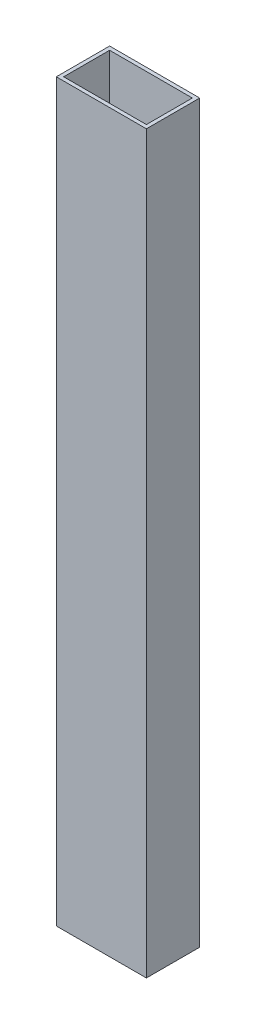
ISO-10303-21;
HEADER;
FILE_DESCRIPTION(('STEP AP214'),'2;1');
FILE_NAME('part.step','',(''),(''),'','','');
FILE_SCHEMA(('AUTOMOTIVE_DESIGN { 1 0 10303 214 1 1 1 1 }'));
ENDSEC;
DATA;
#1=APPLICATION_CONTEXT('core data for automotive mechanical design processes');
#2=APPLICATION_PROTOCOL_DEFINITION('international standard','automotive_design',2000,#1);
#3=PRODUCT_CONTEXT('',#1,'mechanical');
#4=PRODUCT('Part','Part','',(#3));
#5=PRODUCT_RELATED_PRODUCT_CATEGORY('part','',(#4));
#6=PRODUCT_DEFINITION_FORMATION('','',#4);
#7=PRODUCT_DEFINITION_CONTEXT('part definition',#1,'design');
#8=PRODUCT_DEFINITION('design','',#6,#7);
#9=PRODUCT_DEFINITION_SHAPE('','',#8);
#10=(LENGTH_UNIT() NAMED_UNIT(*) SI_UNIT(.MILLI.,.METRE.));
#11=(NAMED_UNIT(*) PLANE_ANGLE_UNIT() SI_UNIT($,.RADIAN.));
#12=(NAMED_UNIT(*) SI_UNIT($,.STERADIAN.) SOLID_ANGLE_UNIT());
#13=UNCERTAINTY_MEASURE_WITH_UNIT(LENGTH_MEASURE(1.E-05),#10,'distance_accuracy_value','');
#14=(GEOMETRIC_REPRESENTATION_CONTEXT(3) GLOBAL_UNCERTAINTY_ASSIGNED_CONTEXT((#13)) GLOBAL_UNIT_ASSIGNED_CONTEXT((#10,
#11,#12)) REPRESENTATION_CONTEXT('',''));
#15=CARTESIAN_POINT('',(0.,0.,0.));
#16=DIRECTION('',(0.,0.,1.));
#17=DIRECTION('',(1.,0.,0.));
#18=AXIS2_PLACEMENT_3D('',#15,#16,#17);
#19=CARTESIAN_POINT('',(0.,200.,0.));
#20=DIRECTION('',(0.,1.,0.));
#21=DIRECTION('',(0.,0.,1.));
#22=AXIS2_PLACEMENT_3D('',#19,#20,#21);
#23=PLANE('',#22);
#24=DIRECTION('',(0.,0.,-1.));
#25=VECTOR('',#24,1.);
#26=CARTESIAN_POINT('',(24.5,200.,-14.5));
#27=LINE('',#26,#25);
#28=CARTESIAN_POINT('',(24.5,200.,14.5));
#29=VERTEX_POINT('',#28);
#30=CARTESIAN_POINT('',(24.5,200.,-14.5));
#31=VERTEX_POINT('',#30);
#32=EDGE_CURVE('E136',#29,#31,#27,.T.);
#33=ORIENTED_EDGE('',*,*,#32,.T.);
#34=DIRECTION('',(-1.,0.,0.));
#35=VECTOR('',#34,1.);
#36=CARTESIAN_POINT('',(-24.5,200.,-14.5));
#37=LINE('',#36,#35);
#38=CARTESIAN_POINT('',(-24.5,200.,-14.5));
#39=VERTEX_POINT('',#38);
#40=EDGE_CURVE('E139',#31,#39,#37,.T.);
#41=ORIENTED_EDGE('',*,*,#40,.T.);
#42=DIRECTION('',(0.,0.,1.));
#43=VECTOR('',#42,1.);
#44=CARTESIAN_POINT('',(-24.5,200.,-14.5));
#45=LINE('',#44,#43);
#46=CARTESIAN_POINT('',(-24.5,200.,14.5));
#47=VERTEX_POINT('',#46);
#48=EDGE_CURVE('E142',#39,#47,#45,.T.);
#49=ORIENTED_EDGE('',*,*,#48,.T.);
#50=DIRECTION('',(1.,0.,0.));
#51=VECTOR('',#50,1.);
#52=CARTESIAN_POINT('',(-24.5,200.,14.5));
#53=LINE('',#52,#51);
#54=EDGE_CURVE('E144',#47,#29,#53,.T.);
#55=ORIENTED_EDGE('',*,*,#54,.T.);
#56=EDGE_LOOP('',(#33,#41,#49,#55));
#57=FACE_BOUND('',#56,.T.);
#58=DIRECTION('',(-1.,0.,0.));
#59=VECTOR('',#58,1.);
#60=CARTESIAN_POINT('',(-22.5,200.,-12.5));
#61=LINE('',#60,#59);
#62=CARTESIAN_POINT('',(22.5,200.,-12.5));
#63=VERTEX_POINT('',#62);
#64=CARTESIAN_POINT('',(-22.5,200.,-12.5));
#65=VERTEX_POINT('',#64);
#66=EDGE_CURVE('E108',#63,#65,#61,.T.);
#67=ORIENTED_EDGE('',*,*,#66,.F.);
#68=DIRECTION('',(0.,0.,-1.));
#69=VECTOR('',#68,1.);
#70=CARTESIAN_POINT('',(22.5,200.,-12.5));
#71=LINE('',#70,#69);
#72=CARTESIAN_POINT('',(22.5,200.,12.5));
#73=VERTEX_POINT('',#72);
#74=EDGE_CURVE('E100',#73,#63,#71,.T.);
#75=ORIENTED_EDGE('',*,*,#74,.F.);
#76=DIRECTION('',(1.,0.,0.));
#77=VECTOR('',#76,1.);
#78=CARTESIAN_POINT('',(-22.5,200.,12.5));
#79=LINE('',#78,#77);
#80=CARTESIAN_POINT('',(-22.5,200.,12.5));
#81=VERTEX_POINT('',#80);
#82=EDGE_CURVE('E122',#81,#73,#79,.T.);
#83=ORIENTED_EDGE('',*,*,#82,.F.);
#84=DIRECTION('',(0.,0.,1.));
#85=VECTOR('',#84,1.);
#86=CARTESIAN_POINT('',(-22.5,200.,-12.5));
#87=LINE('',#86,#85);
#88=EDGE_CURVE('E120',#65,#81,#87,.T.);
#89=ORIENTED_EDGE('',*,*,#88,.F.);
#90=EDGE_LOOP('',(#67,#75,#83,#89));
#91=FACE_BOUND('',#90,.T.);
#92=ADVANCED_FACE('F35',(#57,#91),#23,.T.);
#93=CARTESIAN_POINT('',(0.,-200.,0.));
#94=DIRECTION('',(0.,1.,0.));
#95=DIRECTION('',(0.,0.,1.));
#96=AXIS2_PLACEMENT_3D('',#93,#94,#95);
#97=PLANE('',#96);
#98=DIRECTION('',(0.,0.,-1.));
#99=VECTOR('',#98,1.);
#100=CARTESIAN_POINT('',(24.5,-200.,-14.5));
#101=LINE('',#100,#99);
#102=CARTESIAN_POINT('',(24.5,-200.,14.5));
#103=VERTEX_POINT('',#102);
#104=CARTESIAN_POINT('',(24.5,-200.,-14.5));
#105=VERTEX_POINT('',#104);
#106=EDGE_CURVE('E116',#103,#105,#101,.T.);
#107=ORIENTED_EDGE('',*,*,#106,.F.);
#108=DIRECTION('',(1.,0.,0.));
#109=VECTOR('',#108,1.);
#110=CARTESIAN_POINT('',(-24.5,-200.,14.5));
#111=LINE('',#110,#109);
#112=CARTESIAN_POINT('',(-24.5,-200.,14.5));
#113=VERTEX_POINT('',#112);
#114=EDGE_CURVE('E140',#113,#103,#111,.T.);
#115=ORIENTED_EDGE('',*,*,#114,.F.);
#116=DIRECTION('',(0.,0.,1.));
#117=VECTOR('',#116,1.);
#118=CARTESIAN_POINT('',(-24.5,-200.,-14.5));
#119=LINE('',#118,#117);
#120=CARTESIAN_POINT('',(-24.5,-200.,-14.5));
#121=VERTEX_POINT('',#120);
#122=EDGE_CURVE('E151',#121,#113,#119,.T.);
#123=ORIENTED_EDGE('',*,*,#122,.F.);
#124=DIRECTION('',(-1.,0.,0.));
#125=VECTOR('',#124,1.);
#126=CARTESIAN_POINT('',(-24.5,-200.,-14.5));
#127=LINE('',#126,#125);
#128=EDGE_CURVE('E149',#105,#121,#127,.T.);
#129=ORIENTED_EDGE('',*,*,#128,.F.);
#130=EDGE_LOOP('',(#107,#115,#123,#129));
#131=FACE_BOUND('',#130,.T.);
#132=DIRECTION('',(0.,0.,-1.));
#133=VECTOR('',#132,1.);
#134=CARTESIAN_POINT('',(22.5,-200.,-12.5));
#135=LINE('',#134,#133);
#136=CARTESIAN_POINT('',(22.5,-200.,12.5));
#137=VERTEX_POINT('',#136);
#138=CARTESIAN_POINT('',(22.5,-200.,-12.5));
#139=VERTEX_POINT('',#138);
#140=EDGE_CURVE('E58',#137,#139,#135,.T.);
#141=ORIENTED_EDGE('',*,*,#140,.T.);
#142=DIRECTION('',(-1.,0.,0.));
#143=VECTOR('',#142,1.);
#144=CARTESIAN_POINT('',(-22.5,-200.,-12.5));
#145=LINE('',#144,#143);
#146=CARTESIAN_POINT('',(-22.5,-200.,-12.5));
#147=VERTEX_POINT('',#146);
#148=EDGE_CURVE('E115',#139,#147,#145,.T.);
#149=ORIENTED_EDGE('',*,*,#148,.T.);
#150=DIRECTION('',(0.,0.,1.));
#151=VECTOR('',#150,1.);
#152=CARTESIAN_POINT('',(-22.5,-200.,-12.5));
#153=LINE('',#152,#151);
#154=CARTESIAN_POINT('',(-22.5,-200.,12.5));
#155=VERTEX_POINT('',#154);
#156=EDGE_CURVE('E128',#147,#155,#153,.T.);
#157=ORIENTED_EDGE('',*,*,#156,.T.);
#158=DIRECTION('',(1.,0.,0.));
#159=VECTOR('',#158,1.);
#160=CARTESIAN_POINT('',(-22.5,-200.,12.5));
#161=LINE('',#160,#159);
#162=EDGE_CURVE('E109',#155,#137,#161,.T.);
#163=ORIENTED_EDGE('',*,*,#162,.T.);
#164=EDGE_LOOP('',(#141,#149,#157,#163));
#165=FACE_BOUND('',#164,.T.);
#166=ADVANCED_FACE('F169',(#131,#165),#97,.F.);
#167=CARTESIAN_POINT('',(24.5,200.,-14.5));
#168=DIRECTION('',(-1.,0.,0.));
#169=DIRECTION('',(0.,0.,1.));
#170=AXIS2_PLACEMENT_3D('',#167,#168,#169);
#171=PLANE('',#170);
#172=ORIENTED_EDGE('',*,*,#106,.T.);
#173=DIRECTION('',(0.,-1.,0.));
#174=VECTOR('',#173,1.);
#175=CARTESIAN_POINT('',(24.5,200.,-14.5));
#176=LINE('',#175,#174);
#177=EDGE_CURVE('E11',#31,#105,#176,.T.);
#178=ORIENTED_EDGE('',*,*,#177,.F.);
#179=ORIENTED_EDGE('',*,*,#32,.F.);
#180=DIRECTION('',(0.,-1.,0.));
#181=VECTOR('',#180,1.);
#182=CARTESIAN_POINT('',(24.5,200.,14.5));
#183=LINE('',#182,#181);
#184=EDGE_CURVE('E146',#29,#103,#183,.T.);
#185=ORIENTED_EDGE('',*,*,#184,.T.);
#186=EDGE_LOOP('',(#172,#178,#179,#185));
#187=FACE_BOUND('',#186,.T.);
#188=ADVANCED_FACE('F37',(#187),#171,.F.);
#189=CARTESIAN_POINT('',(-24.5,200.,-14.5));
#190=DIRECTION('',(0.,0.,1.));
#191=DIRECTION('',(1.,0.,0.));
#192=AXIS2_PLACEMENT_3D('',#189,#190,#191);
#193=PLANE('',#192);
#194=ORIENTED_EDGE('',*,*,#128,.T.);
#195=DIRECTION('',(0.,-1.,0.));
#196=VECTOR('',#195,1.);
#197=CARTESIAN_POINT('',(-24.5,200.,-14.5));
#198=LINE('',#197,#196);
#199=EDGE_CURVE('E43',#39,#121,#198,.T.);
#200=ORIENTED_EDGE('',*,*,#199,.F.);
#201=ORIENTED_EDGE('',*,*,#40,.F.);
#202=ORIENTED_EDGE('',*,*,#177,.T.);
#203=EDGE_LOOP('',(#194,#200,#201,#202));
#204=FACE_BOUND('',#203,.T.);
#205=ADVANCED_FACE('F179',(#204),#193,.F.);
#206=CARTESIAN_POINT('',(-24.5,200.,-14.5));
#207=DIRECTION('',(1.,0.,0.));
#208=DIRECTION('',(0.,0.,-1.));
#209=AXIS2_PLACEMENT_3D('',#206,#207,#208);
#210=PLANE('',#209);
#211=ORIENTED_EDGE('',*,*,#122,.T.);
#212=DIRECTION('',(0.,-1.,0.));
#213=VECTOR('',#212,1.);
#214=CARTESIAN_POINT('',(-24.5,200.,14.5));
#215=LINE('',#214,#213);
#216=EDGE_CURVE('E156',#47,#113,#215,.T.);
#217=ORIENTED_EDGE('',*,*,#216,.F.);
#218=ORIENTED_EDGE('',*,*,#48,.F.);
#219=ORIENTED_EDGE('',*,*,#199,.T.);
#220=EDGE_LOOP('',(#211,#217,#218,#219));
#221=FACE_BOUND('',#220,.T.);
#222=ADVANCED_FACE('F163',(#221),#210,.F.);
#223=CARTESIAN_POINT('',(-24.5,200.,14.5));
#224=DIRECTION('',(0.,0.,-1.));
#225=DIRECTION('',(-1.,0.,0.));
#226=AXIS2_PLACEMENT_3D('',#223,#224,#225);
#227=PLANE('',#226);
#228=ORIENTED_EDGE('',*,*,#114,.T.);
#229=ORIENTED_EDGE('',*,*,#184,.F.);
#230=ORIENTED_EDGE('',*,*,#54,.F.);
#231=ORIENTED_EDGE('',*,*,#216,.T.);
#232=EDGE_LOOP('',(#228,#229,#230,#231));
#233=FACE_BOUND('',#232,.T.);
#234=ADVANCED_FACE('F173',(#233),#227,.F.);
#235=CARTESIAN_POINT('',(22.5,200.,-12.5));
#236=DIRECTION('',(-1.,0.,0.));
#237=DIRECTION('',(0.,0.,1.));
#238=AXIS2_PLACEMENT_3D('',#235,#236,#237);
#239=PLANE('',#238);
#240=ORIENTED_EDGE('',*,*,#140,.F.);
#241=DIRECTION('',(0.,-1.,0.));
#242=VECTOR('',#241,1.);
#243=CARTESIAN_POINT('',(22.5,200.,12.5));
#244=LINE('',#243,#242);
#245=EDGE_CURVE('E104',#73,#137,#244,.T.);
#246=ORIENTED_EDGE('',*,*,#245,.F.);
#247=ORIENTED_EDGE('',*,*,#74,.T.);
#248=DIRECTION('',(0.,-1.,0.));
#249=VECTOR('',#248,1.);
#250=CARTESIAN_POINT('',(22.5,200.,-12.5));
#251=LINE('',#250,#249);
#252=EDGE_CURVE('E103',#63,#139,#251,.T.);
#253=ORIENTED_EDGE('',*,*,#252,.T.);
#254=EDGE_LOOP('',(#240,#246,#247,#253));
#255=FACE_BOUND('',#254,.T.);
#256=ADVANCED_FACE('F102',(#255),#239,.T.);
#257=CARTESIAN_POINT('',(-22.5,200.,-12.5));
#258=DIRECTION('',(0.,0.,1.));
#259=DIRECTION('',(1.,0.,0.));
#260=AXIS2_PLACEMENT_3D('',#257,#258,#259);
#261=PLANE('',#260);
#262=ORIENTED_EDGE('',*,*,#148,.F.);
#263=ORIENTED_EDGE('',*,*,#252,.F.);
#264=ORIENTED_EDGE('',*,*,#66,.T.);
#265=DIRECTION('',(0.,-1.,0.));
#266=VECTOR('',#265,1.);
#267=CARTESIAN_POINT('',(-22.5,200.,-12.5));
#268=LINE('',#267,#266);
#269=EDGE_CURVE('E117',#65,#147,#268,.T.);
#270=ORIENTED_EDGE('',*,*,#269,.T.);
#271=EDGE_LOOP('',(#262,#263,#264,#270));
#272=FACE_BOUND('',#271,.T.);
#273=ADVANCED_FACE('F112',(#272),#261,.T.);
#274=CARTESIAN_POINT('',(-22.5,200.,-12.5));
#275=DIRECTION('',(1.,0.,0.));
#276=DIRECTION('',(0.,0.,-1.));
#277=AXIS2_PLACEMENT_3D('',#274,#275,#276);
#278=PLANE('',#277);
#279=ORIENTED_EDGE('',*,*,#156,.F.);
#280=ORIENTED_EDGE('',*,*,#269,.F.);
#281=ORIENTED_EDGE('',*,*,#88,.T.);
#282=DIRECTION('',(0.,-1.,0.));
#283=VECTOR('',#282,1.);
#284=CARTESIAN_POINT('',(-22.5,200.,12.5));
#285=LINE('',#284,#283);
#286=EDGE_CURVE('E50',#81,#155,#285,.T.);
#287=ORIENTED_EDGE('',*,*,#286,.T.);
#288=EDGE_LOOP('',(#279,#280,#281,#287));
#289=FACE_BOUND('',#288,.T.);
#290=ADVANCED_FACE('F202',(#289),#278,.T.);
#291=CARTESIAN_POINT('',(-22.5,200.,12.5));
#292=DIRECTION('',(0.,0.,-1.));
#293=DIRECTION('',(-1.,0.,0.));
#294=AXIS2_PLACEMENT_3D('',#291,#292,#293);
#295=PLANE('',#294);
#296=ORIENTED_EDGE('',*,*,#162,.F.);
#297=ORIENTED_EDGE('',*,*,#286,.F.);
#298=ORIENTED_EDGE('',*,*,#82,.T.);
#299=ORIENTED_EDGE('',*,*,#245,.T.);
#300=EDGE_LOOP('',(#296,#297,#298,#299));
#301=FACE_BOUND('',#300,.T.);
#302=ADVANCED_FACE('F206',(#301),#295,.T.);
#303=CLOSED_SHELL('',(#92,#166,#188,#205,#222,#234,#256,#273,#290,#302));
#304=MANIFOLD_SOLID_BREP('B2',#303);
#305=ADVANCED_BREP_SHAPE_REPRESENTATION('',(#18,#304),#14);
#306=SHAPE_DEFINITION_REPRESENTATION(#9,#305);
ENDSEC;
END-ISO-10303-21;
